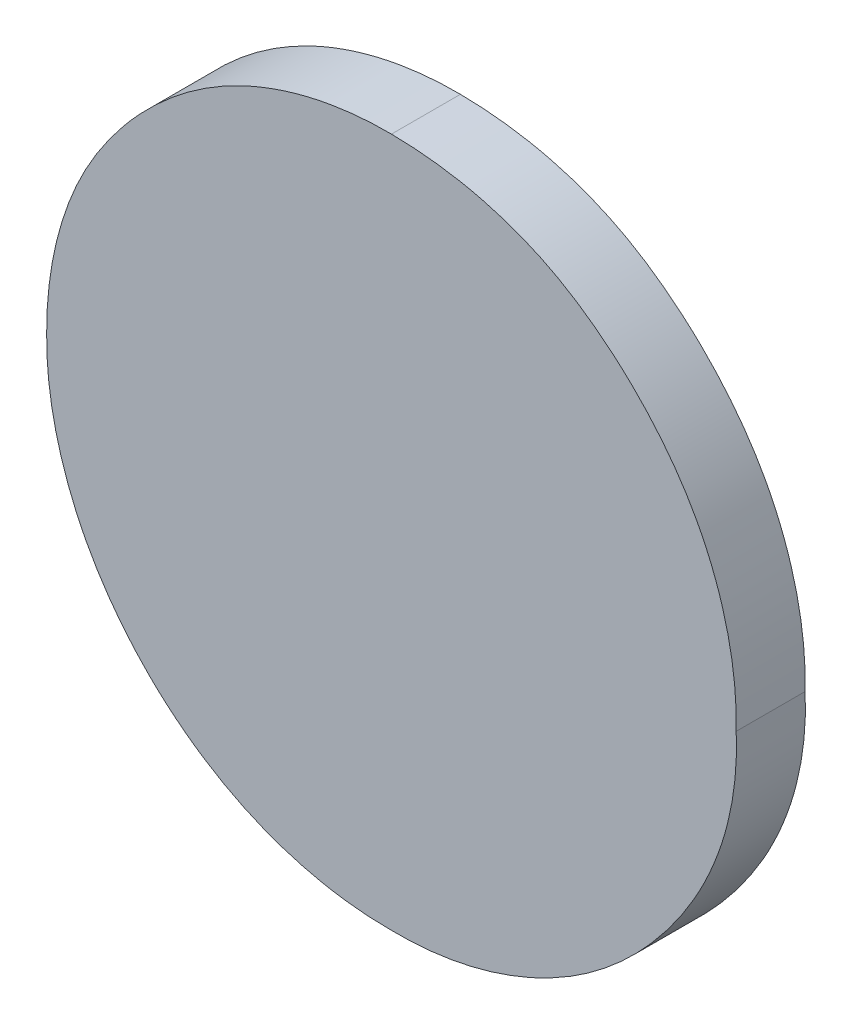
ISO-10303-21;
HEADER;
FILE_DESCRIPTION(('STEP AP214'),'2;1');
FILE_NAME('part.step','',(''),(''),'','','');
FILE_SCHEMA(('AUTOMOTIVE_DESIGN { 1 0 10303 214 1 1 1 1 }'));
ENDSEC;
DATA;
#1=APPLICATION_CONTEXT('core data for automotive mechanical design processes');
#2=APPLICATION_PROTOCOL_DEFINITION('international standard','automotive_design',2000,#1);
#3=PRODUCT_CONTEXT('',#1,'mechanical');
#4=PRODUCT('Part','Part','',(#3));
#5=PRODUCT_RELATED_PRODUCT_CATEGORY('part','',(#4));
#6=PRODUCT_DEFINITION_FORMATION('','',#4);
#7=PRODUCT_DEFINITION_CONTEXT('part definition',#1,'design');
#8=PRODUCT_DEFINITION('design','',#6,#7);
#9=PRODUCT_DEFINITION_SHAPE('','',#8);
#10=(LENGTH_UNIT() NAMED_UNIT(*) SI_UNIT(.MILLI.,.METRE.));
#11=(NAMED_UNIT(*) PLANE_ANGLE_UNIT() SI_UNIT($,.RADIAN.));
#12=(NAMED_UNIT(*) SI_UNIT($,.STERADIAN.) SOLID_ANGLE_UNIT());
#13=UNCERTAINTY_MEASURE_WITH_UNIT(LENGTH_MEASURE(1.E-05),#10,'distance_accuracy_value','');
#14=(GEOMETRIC_REPRESENTATION_CONTEXT(3) GLOBAL_UNCERTAINTY_ASSIGNED_CONTEXT((#13)) GLOBAL_UNIT_ASSIGNED_CONTEXT((#10,
#11,#12)) REPRESENTATION_CONTEXT('',''));
#15=CARTESIAN_POINT('',(0.,0.,0.));
#16=DIRECTION('',(0.,0.,1.));
#17=DIRECTION('',(1.,0.,0.));
#18=AXIS2_PLACEMENT_3D('',#15,#16,#17);
#19=CARTESIAN_POINT('',(0.44905628818307,1.01311472539116,0.551));
#20=CARTESIAN_POINT('',(0.44905628818307,1.01311472539116,0.55));
#21=CARTESIAN_POINT('',(0.449074495598878,1.01345328618512,0.551));
#22=CARTESIAN_POINT('',(0.449074495598878,1.01345328618512,0.55));
#23=CARTESIAN_POINT('',(0.449110043343719,1.0141142845851,0.551));
#24=CARTESIAN_POINT('',(0.449110043343719,1.0141142845851,0.55));
#25=CARTESIAN_POINT('',(0.449397626090893,1.015060554999,0.551));
#26=CARTESIAN_POINT('',(0.449397626090893,1.015060554999,0.55));
#27=CARTESIAN_POINT('',(0.449866932580689,1.01592058538614,0.551));
#28=CARTESIAN_POINT('',(0.449866932580689,1.01592058538614,0.55));
#29=CARTESIAN_POINT('',(0.450501310780555,1.01668166961683,0.551));
#30=CARTESIAN_POINT('',(0.450501310780555,1.01668166961683,0.55));
#31=CARTESIAN_POINT('',(0.451264584424357,1.01731916623396,0.551));
#32=CARTESIAN_POINT('',(0.451264584424357,1.01731916623396,0.55));
#33=CARTESIAN_POINT('',(0.452126805084551,1.01778313411635,0.551));
#34=CARTESIAN_POINT('',(0.452126805084551,1.01778313411635,0.55));
#35=CARTESIAN_POINT('',(0.453070340061191,1.01805811261096,0.551));
#36=CARTESIAN_POINT('',(0.453070340061191,1.01805811261096,0.55));
#37=CARTESIAN_POINT('',(0.453721939005433,1.01809552718379,0.551));
#38=CARTESIAN_POINT('',(0.453721939005433,1.01809552718379,0.55));
#39=CARTESIAN_POINT('',(0.45405628818307,1.01811472539116,0.551));
#40=CARTESIAN_POINT('',(0.45405628818307,1.01811472539116,0.55));
#41=B_SPLINE_SURFACE_WITH_KNOTS('',3,1,((#19,#20),(#21,#22),(#23,#24),(#25,#26),(#27,#28),(#29,
#30),(#31,#32),(#33,#34),(#35,#36),(#37,#38),(#39,#40)),.UNSPECIFIED.,.F.,.F.,.F.,(4,1,1,1,1,1,
1,1,4),(2,2),(0.,0.129096958167225,0.25204596725998,0.373904964402,0.501037835220211,
0.628170706038421,0.751376463409198,0.872426013370455,1.),(0.,1.),.UNSPECIFIED.);
#42=CARTESIAN_POINT('',(0.44905628818307,1.01311472539116,0.55));
#43=CARTESIAN_POINT('',(0.449054935449828,1.01345517990915,0.55));
#44=CARTESIAN_POINT('',(0.449087450089312,1.01379781815018,0.55));
#45=CARTESIAN_POINT('',(0.44923707957092,1.01455150678429,0.55));
#46=CARTESIAN_POINT('',(0.449372831094389,1.01495895061159,0.55));
#47=CARTESIAN_POINT('',(0.44975417080457,1.01572544032933,0.55));
#48=CARTESIAN_POINT('',(0.450001417509122,1.01608364470744,0.55));
#49=CARTESIAN_POINT('',(0.450628704194548,1.01679879499822,0.55));
#50=CARTESIAN_POINT('',(0.451025341191159,1.01714146095945,0.55));
#51=CARTESIAN_POINT('',(0.451870169674499,1.01765527462897,0.55));
#52=CARTESIAN_POINT('',(0.452310703467792,1.01783890743527,0.55));
#53=CARTESIAN_POINT('',(0.45318865721681,1.01806600906221,0.55));
#54=CARTESIAN_POINT('',(0.45362349226333,1.01811953971669,0.55));
#55=CARTESIAN_POINT('',(0.45405628818307,1.01811472539116,0.55));
#56=B_SPLINE_CURVE_WITH_KNOTS('',3,(#42,#43,#44,#45,#46,#47,#48,#49,#50,#51,#52,#53,#54,#55),
.UNSPECIFIED.,.F.,.F.,(4,2,2,2,2,2,4),(0.,0.00102380235933688,0.00229637067166441,
0.00358852723842867,0.00513641999990213,0.00654746971819192,0.00784533010584381),.UNSPECIFIED.);
#57=CARTESIAN_POINT('',(0.44905628818307,1.01311472539116,0.55));
#58=VERTEX_POINT('',#57);
#59=CARTESIAN_POINT('',(0.45405628818307,1.01811472539116,0.55));
#60=VERTEX_POINT('',#59);
#61=EDGE_CURVE('E11',#58,#60,#56,.T.);
#62=DIRECTION('',(0.,0.,-1.));
#63=VECTOR('',#62,1.);
#64=CARTESIAN_POINT('',(0.44905628818307,1.01311472539116,0.551));
#65=LINE('',#64,#63);
#66=CARTESIAN_POINT('',(0.44905628818307,1.01311472539116,0.551));
#67=VERTEX_POINT('',#66);
#68=EDGE_CURVE('E135',#67,#58,#65,.T.);
#69=CARTESIAN_POINT('',(0.44905628818307,1.01311472539116,0.551));
#70=CARTESIAN_POINT('',(0.449054935449828,1.01345517990915,0.551));
#71=CARTESIAN_POINT('',(0.449087450089312,1.01379781815018,0.551));
#72=CARTESIAN_POINT('',(0.44923707957092,1.01455150678428,0.551));
#73=CARTESIAN_POINT('',(0.44937283109439,1.01495895061159,0.551));
#74=CARTESIAN_POINT('',(0.44975417080457,1.01572544032933,0.551));
#75=CARTESIAN_POINT('',(0.450001417509122,1.01608364470744,0.551));
#76=CARTESIAN_POINT('',(0.450628704194548,1.01679879499822,0.551));
#77=CARTESIAN_POINT('',(0.45102534119116,1.01714146095945,0.551));
#78=CARTESIAN_POINT('',(0.4518701696745,1.01765527462897,0.551));
#79=CARTESIAN_POINT('',(0.452310703467792,1.01783890743527,0.551));
#80=CARTESIAN_POINT('',(0.453188657216809,1.01806600906221,0.551));
#81=CARTESIAN_POINT('',(0.453623492263329,1.01811953971669,0.551));
#82=CARTESIAN_POINT('',(0.45405628818307,1.01811472539116,0.551));
#83=B_SPLINE_CURVE_WITH_KNOTS('',3,(#69,#70,#71,#72,#73,#74,#75,#76,#77,#78,#79,#80,#81,#82),
.UNSPECIFIED.,.F.,.F.,(4,2,2,2,2,2,4),(0.,0.00102380235933688,0.00229637067166441,
0.00358852723842867,0.00513641999990287,0.00654746971819082,0.00784533010584373),.UNSPECIFIED.);
#84=CARTESIAN_POINT('',(0.45405628818307,1.01811472539116,0.551));
#85=VERTEX_POINT('',#84);
#86=EDGE_CURVE('E143',#67,#85,#83,.T.);
#87=DIRECTION('',(0.,0.,-1.));
#88=VECTOR('',#87,1.);
#89=CARTESIAN_POINT('',(0.45405628818307,1.01811472539116,0.551));
#90=LINE('',#89,#88);
#91=EDGE_CURVE('E80',#85,#60,#90,.T.);
#92=ORIENTED_EDGE('',*,*,#61,.F.);
#93=ORIENTED_EDGE('',*,*,#68,.F.);
#94=ORIENTED_EDGE('',*,*,#86,.T.);
#95=ORIENTED_EDGE('',*,*,#91,.T.);
#96=EDGE_LOOP('',(#92,#93,#94,#95));
#97=FACE_BOUND('',#96,.T.);
#98=ADVANCED_FACE('F17',(#97),#41,.T.);
#99=CARTESIAN_POINT('',(0.45405628818307,1.00811472539116,0.551));
#100=CARTESIAN_POINT('',(0.45405628818307,1.00811472539116,0.55));
#101=CARTESIAN_POINT('',(0.453721558371895,1.00813261562845,0.551));
#102=CARTESIAN_POINT('',(0.453721558371895,1.00813261562845,0.55));
#103=CARTESIAN_POINT('',(0.453068078098445,1.00816754205798,0.551));
#104=CARTESIAN_POINT('',(0.453068078098445,1.00816754205798,0.55));
#105=CARTESIAN_POINT('',(0.452128889625928,1.00846176159417,0.551));
#106=CARTESIAN_POINT('',(0.452128889625928,1.00846176159417,0.55));
#107=CARTESIAN_POINT('',(0.451264770164578,1.00892159234121,0.551));
#108=CARTESIAN_POINT('',(0.451264770164578,1.00892159234121,0.55));
#109=CARTESIAN_POINT('',(0.450496980820515,1.00956045364663,0.551));
#110=CARTESIAN_POINT('',(0.450496980820515,1.00956045364663,0.55));
#111=CARTESIAN_POINT('',(0.449870607021862,1.01033188467627,0.551));
#112=CARTESIAN_POINT('',(0.449870607021862,1.01033188467627,0.55));
#113=CARTESIAN_POINT('',(0.449397029030096,1.01119248690081,0.551));
#114=CARTESIAN_POINT('',(0.449397029030096,1.01119248690081,0.55));
#115=CARTESIAN_POINT('',(0.449112626476617,1.0121315972565,0.551));
#116=CARTESIAN_POINT('',(0.449112626476617,1.0121315972565,0.55));
#117=CARTESIAN_POINT('',(0.449075222945185,1.01278430541948,0.551));
#118=CARTESIAN_POINT('',(0.449075222945185,1.01278430541948,0.55));
#119=CARTESIAN_POINT('',(0.44905628818307,1.01311472539116,0.551));
#120=CARTESIAN_POINT('',(0.44905628818307,1.01311472539116,0.55));
#121=B_SPLINE_SURFACE_WITH_KNOTS('',3,1,((#99,#100),(#101,#102),(#103,#104),(#105,#106),(#107,
#108),(#109,#110),(#111,#112),(#113,#114),(#115,#116),(#117,#118),(#119,#120)),.UNSPECIFIED.,
.F.,.F.,.F.,(4,1,1,1,1,1,1,1,4),(2,2),(0.,0.127756603310131,0.24941435533653,0.372796476455405,
0.500111332515852,0.628609940765116,0.750643373825818,0.87376837914253,1.),(0.,1.),.UNSPECIFIED.);
#122=CARTESIAN_POINT('',(0.45405628818307,1.00811472539116,0.55));
#123=CARTESIAN_POINT('',(0.453718786892706,1.00811250210859,0.55));
#124=CARTESIAN_POINT('',(0.453380698374391,1.00814558278958,0.55));
#125=CARTESIAN_POINT('',(0.452640413714965,1.00829533080317,0.55));
#126=CARTESIAN_POINT('',(0.452241724402039,1.00842974288875,0.55));
#127=CARTESIAN_POINT('',(0.451423404943235,1.00883057793831,0.55));
#128=CARTESIAN_POINT('',(0.451013365480481,1.00911670458406,0.55));
#129=CARTESIAN_POINT('',(0.45028779676664,1.0097955714469,0.55));
#130=CARTESIAN_POINT('',(0.449973178061196,1.01018927459045,0.55));
#131=CARTESIAN_POINT('',(0.44947847401318,1.01104222215109,0.55));
#132=CARTESIAN_POINT('',(0.449295398722524,1.01149970740789,0.55));
#133=CARTESIAN_POINT('',(0.449095224348268,1.01234700875374,0.55));
#134=CARTESIAN_POINT('',(0.449051220069847,1.01273068588496,0.55));
#135=CARTESIAN_POINT('',(0.44905628818307,1.01311472539116,0.55));
#136=B_SPLINE_CURVE_WITH_KNOTS('',3,(#122,#123,#124,#125,#126,#127,#128,#129,#130,#131,#132,
#133,#134,#135),.UNSPECIFIED.,.F.,.F.,(4,2,2,2,2,2,4),(0.,0.00101171540562987,
0.00226012530857957,0.00373770364105078,0.00522896754965536,0.00668515982762755,
0.00783352206638879),.UNSPECIFIED.);
#137=CARTESIAN_POINT('',(0.45405628818307,1.00811472539116,0.55));
#138=VERTEX_POINT('',#137);
#139=EDGE_CURVE('E32',#138,#58,#136,.T.);
#140=DIRECTION('',(0.,0.,-1.));
#141=VECTOR('',#140,1.);
#142=CARTESIAN_POINT('',(0.45405628818307,1.00811472539116,0.551));
#143=LINE('',#142,#141);
#144=CARTESIAN_POINT('',(0.45405628818307,1.00811472539116,0.551));
#145=VERTEX_POINT('',#144);
#146=EDGE_CURVE('E142',#145,#138,#143,.T.);
#147=CARTESIAN_POINT('',(0.45405628818307,1.00811472539116,0.551));
#148=CARTESIAN_POINT('',(0.453718786892706,1.00811250210859,0.551));
#149=CARTESIAN_POINT('',(0.453380698374391,1.00814558278958,0.551));
#150=CARTESIAN_POINT('',(0.452640413714965,1.00829533080317,0.551));
#151=CARTESIAN_POINT('',(0.452241724402039,1.00842974288875,0.551));
#152=CARTESIAN_POINT('',(0.451423404943235,1.00883057793831,0.551));
#153=CARTESIAN_POINT('',(0.451013365480481,1.00911670458406,0.551));
#154=CARTESIAN_POINT('',(0.45028779676664,1.0097955714469,0.551));
#155=CARTESIAN_POINT('',(0.449973178061196,1.01018927459045,0.551));
#156=CARTESIAN_POINT('',(0.44947847401318,1.01104222215109,0.551));
#157=CARTESIAN_POINT('',(0.449295398722524,1.01149970740789,0.551));
#158=CARTESIAN_POINT('',(0.449095224348268,1.01234700875374,0.551));
#159=CARTESIAN_POINT('',(0.449051220069847,1.01273068588496,0.551));
#160=CARTESIAN_POINT('',(0.44905628818307,1.01311472539116,0.551));
#161=B_SPLINE_CURVE_WITH_KNOTS('',3,(#147,#148,#149,#150,#151,#152,#153,#154,#155,#156,#157,
#158,#159,#160),.UNSPECIFIED.,.F.,.F.,(4,2,2,2,2,2,4),(0.,0.00101171540562987,
0.00226012530857957,0.00373770364105078,0.00522896754965536,0.00668515982762755,
0.00783352206638879),.UNSPECIFIED.);
#162=EDGE_CURVE('E74',#145,#67,#161,.T.);
#163=ORIENTED_EDGE('',*,*,#139,.F.);
#164=ORIENTED_EDGE('',*,*,#146,.F.);
#165=ORIENTED_EDGE('',*,*,#162,.T.);
#166=ORIENTED_EDGE('',*,*,#68,.T.);
#167=EDGE_LOOP('',(#163,#164,#165,#166));
#168=FACE_BOUND('',#167,.T.);
#169=ADVANCED_FACE('F118',(#168),#121,.T.);
#170=CARTESIAN_POINT('',(0.45905628818307,1.01311472539116,0.551));
#171=CARTESIAN_POINT('',(0.45905628818307,1.01311472539116,0.55));
#172=CARTESIAN_POINT('',(0.45903579217029,1.01278483973809,0.551));
#173=CARTESIAN_POINT('',(0.45903579217029,1.01278483973809,0.55));
#174=CARTESIAN_POINT('',(0.458995374334092,1.0121343100749,0.551));
#175=CARTESIAN_POINT('',(0.458995374334092,1.0121343100749,0.55));
#176=CARTESIAN_POINT('',(0.458733729623309,1.01118662785849,0.551));
#177=CARTESIAN_POINT('',(0.458733729623309,1.01118662785849,0.55));
#178=CARTESIAN_POINT('',(0.458238334476508,1.01033588092472,0.551));
#179=CARTESIAN_POINT('',(0.458238334476508,1.01033588092472,0.55));
#180=CARTESIAN_POINT('',(0.457617163169269,1.00955927284252,0.551));
#181=CARTESIAN_POINT('',(0.457617163169269,1.00955927284252,0.55));
#182=CARTESIAN_POINT('',(0.45684922430827,1.00892600077495,0.551));
#183=CARTESIAN_POINT('',(0.45684922430827,1.00892600077495,0.55));
#184=CARTESIAN_POINT('',(0.455990335512453,1.00845588629383,0.551));
#185=CARTESIAN_POINT('',(0.455990335512453,1.00845588629383,0.55));
#186=CARTESIAN_POINT('',(0.45504762822976,1.00816973806681,0.551));
#187=CARTESIAN_POINT('',(0.45504762822976,1.00816973806681,0.55));
#188=CARTESIAN_POINT('',(0.454390776972362,1.00813328725934,0.551));
#189=CARTESIAN_POINT('',(0.454390776972362,1.00813328725934,0.55));
#190=CARTESIAN_POINT('',(0.45405628818307,1.00811472539116,0.551));
#191=CARTESIAN_POINT('',(0.45405628818307,1.00811472539116,0.55));
#192=B_SPLINE_SURFACE_WITH_KNOTS('',3,1,((#170,#171),(#172,#173),(#174,#175),(#176,#177),(#178,
#179),(#180,#181),(#182,#183),(#184,#185),(#186,#187),(#188,#189),(#190,#191)),.UNSPECIFIED.,
.F.,.F.,.F.,(4,1,1,1,1,1,1,1,4),(2,2),(0.,0.12617771831699,0.248820607485782,0.371539969235141,
0.499983706910885,0.627244197875359,0.749225521076267,0.872297950417651,1.),(0.,1.),.UNSPECIFIED.);
#193=CARTESIAN_POINT('',(0.45905628818307,1.01311472539116,0.55));
#194=CARTESIAN_POINT('',(0.459091698220716,1.01231128479108,0.55));
#195=CARTESIAN_POINT('',(0.458893242729008,1.0115495939592,0.55));
#196=CARTESIAN_POINT('',(0.45835147045371,1.01051718944485,0.55));
#197=CARTESIAN_POINT('',(0.45812442781851,1.01018703419215,0.55));
#198=CARTESIAN_POINT('',(0.457557804992493,1.009524243865,0.55));
#199=CARTESIAN_POINT('',(0.457205114765354,1.00920271206402,0.55));
#200=CARTESIAN_POINT('',(0.456398014024578,1.00865962360957,0.55));
#201=CARTESIAN_POINT('',(0.455938948898806,1.00844481563176,0.55));
#202=CARTESIAN_POINT('',(0.455003796265871,1.00817168531907,0.55));
#203=CARTESIAN_POINT('',(0.454529957278226,1.00810555781945,0.55));
#204=CARTESIAN_POINT('',(0.45405628818307,1.00811472539116,0.55));
#205=B_SPLINE_CURVE_WITH_KNOTS('',3,(#193,#194,#195,#196,#197,#198,#199,#200,#201,#202,#203,
#204),.UNSPECIFIED.,.F.,.F.,(4,2,2,2,2,4),(0.,0.00230515943149246,0.00349686753796663,
0.00491163967331225,0.00640711009768603,0.00782203466010681),.UNSPECIFIED.);
#206=CARTESIAN_POINT('',(0.45905628818307,1.01311472539116,0.55));
#207=VERTEX_POINT('',#206);
#208=EDGE_CURVE('E70',#207,#138,#205,.T.);
#209=DIRECTION('',(0.,0.,-1.));
#210=VECTOR('',#209,1.);
#211=CARTESIAN_POINT('',(0.45905628818307,1.01311472539116,0.551));
#212=LINE('',#211,#210);
#213=CARTESIAN_POINT('',(0.45905628818307,1.01311472539116,0.551));
#214=VERTEX_POINT('',#213);
#215=EDGE_CURVE('E63',#214,#207,#212,.T.);
#216=CARTESIAN_POINT('',(0.45905628818307,1.01311472539116,0.551));
#217=CARTESIAN_POINT('',(0.459091698220716,1.01231128479108,0.551));
#218=CARTESIAN_POINT('',(0.458893242729008,1.0115495939592,0.551));
#219=CARTESIAN_POINT('',(0.45835147045371,1.01051718944485,0.551));
#220=CARTESIAN_POINT('',(0.45812442781851,1.01018703419215,0.551));
#221=CARTESIAN_POINT('',(0.457557804992493,1.009524243865,0.551));
#222=CARTESIAN_POINT('',(0.457205114765354,1.00920271206402,0.551));
#223=CARTESIAN_POINT('',(0.456398014024578,1.00865962360957,0.551));
#224=CARTESIAN_POINT('',(0.455938948898806,1.00844481563176,0.551));
#225=CARTESIAN_POINT('',(0.455003796265871,1.00817168531907,0.551));
#226=CARTESIAN_POINT('',(0.454529957278226,1.00810555781945,0.551));
#227=CARTESIAN_POINT('',(0.45405628818307,1.00811472539116,0.551));
#228=B_SPLINE_CURVE_WITH_KNOTS('',3,(#216,#217,#218,#219,#220,#221,#222,#223,#224,#225,#226,
#227),.UNSPECIFIED.,.F.,.F.,(4,2,2,2,2,4),(0.,0.00230515943149246,0.00349686753796663,
0.00491163967331225,0.00640711009768603,0.00782203466010681),.UNSPECIFIED.);
#229=EDGE_CURVE('E67',#214,#145,#228,.T.);
#230=ORIENTED_EDGE('',*,*,#208,.F.);
#231=ORIENTED_EDGE('',*,*,#215,.F.);
#232=ORIENTED_EDGE('',*,*,#229,.T.);
#233=ORIENTED_EDGE('',*,*,#146,.T.);
#234=EDGE_LOOP('',(#230,#231,#232,#233));
#235=FACE_BOUND('',#234,.T.);
#236=ADVANCED_FACE('F65',(#235),#192,.T.);
#237=CARTESIAN_POINT('',(0.45405628818307,1.01811472539116,0.551));
#238=CARTESIAN_POINT('',(0.45405628818307,1.01811472539116,0.55));
#239=CARTESIAN_POINT('',(0.454390406106035,1.0180948711051,0.551));
#240=CARTESIAN_POINT('',(0.454390406106035,1.0180948711051,0.55));
#241=CARTESIAN_POINT('',(0.455045405232783,1.01805594909843,0.551));
#242=CARTESIAN_POINT('',(0.455045405232783,1.01805594909843,0.55));
#243=CARTESIAN_POINT('',(0.455992361718199,1.0177889204054,0.551));
#244=CARTESIAN_POINT('',(0.455992361718199,1.0177889204054,0.55));
#245=CARTESIAN_POINT('',(0.456849413027574,1.01731477194018,0.551));
#246=CARTESIAN_POINT('',(0.456849413027574,1.01731477194018,0.55));
#247=CARTESIAN_POINT('',(0.457612822938203,1.01668283859683,0.551));
#248=CARTESIAN_POINT('',(0.457612822938203,1.01668283859683,0.55));
#249=CARTESIAN_POINT('',(0.458242076821476,1.01591662722888,0.551));
#250=CARTESIAN_POINT('',(0.458242076821476,1.01591662722888,0.55));
#251=CARTESIAN_POINT('',(0.458733122857953,1.01506641165055,0.551));
#252=CARTESIAN_POINT('',(0.458733122857953,1.01506641165055,0.55));
#253=CARTESIAN_POINT('',(0.458997825461586,1.01411152720633,0.551));
#254=CARTESIAN_POINT('',(0.458997825461586,1.01411152720633,0.55));
#255=CARTESIAN_POINT('',(0.459036463949768,1.0134527327784,0.551));
#256=CARTESIAN_POINT('',(0.459036463949768,1.0134527327784,0.55));
#257=CARTESIAN_POINT('',(0.45905628818307,1.01311472539116,0.551));
#258=CARTESIAN_POINT('',(0.45905628818307,1.01311472539116,0.55));
#259=B_SPLINE_SURFACE_WITH_KNOTS('',3,1,((#237,#238),(#239,#240),(#241,#242),(#243,#244),(#245,
#246),(#247,#248),(#249,#250),(#251,#252),(#253,#254),(#255,#256),(#257,#258)),.UNSPECIFIED.,
.F.,.F.,.F.,(4,1,1,1,1,1,1,1,4),(2,2),(0.,0.127518926699943,0.249985947748801,0.371792351505745,
0.498870352776469,0.625948354047194,0.748491738016055,0.870958759064918,1.),(0.,1.),.UNSPECIFIED.);
#260=CARTESIAN_POINT('',(0.45405628818307,1.01811472539116,0.55));
#261=CARTESIAN_POINT('',(0.454391462387858,1.01811209716723,0.55));
#262=CARTESIAN_POINT('',(0.454730354637737,1.01808049207193,0.55));
#263=CARTESIAN_POINT('',(0.45550245200476,1.01793313615294,0.55));
#264=CARTESIAN_POINT('',(0.45593131932933,1.01779379182381,0.55));
#265=CARTESIAN_POINT('',(0.456710947676083,1.01739734551313,0.55));
#266=CARTESIAN_POINT('',(0.457063895718266,1.01714447941195,0.55));
#267=CARTESIAN_POINT('',(0.457776564947659,1.01650251779543,0.55));
#268=CARTESIAN_POINT('',(0.458120371090322,1.01609563777763,0.55));
#269=CARTESIAN_POINT('',(0.458613138812652,1.01526476239132,0.55));
#270=CARTESIAN_POINT('',(0.458784745626889,1.0148544037533,0.55));
#271=CARTESIAN_POINT('',(0.459011585550635,1.01400071453088,0.55));
#272=CARTESIAN_POINT('',(0.459066266387475,1.0135572376668,0.55));
#273=CARTESIAN_POINT('',(0.45905628818307,1.01311472539116,0.55));
#274=B_SPLINE_CURVE_WITH_KNOTS('',3,(#260,#261,#262,#263,#264,#265,#266,#267,#268,#269,#270,
#271,#272,#273),.UNSPECIFIED.,.F.,.F.,(4,2,2,2,2,2,4),(0.,0.00101182088140865,
0.00234589379881517,0.00363386383793548,0.00520796923802035,0.00652511171315989,
0.00784846178707011),.UNSPECIFIED.);
#275=EDGE_CURVE('E73',#60,#207,#274,.T.);
#276=CARTESIAN_POINT('',(0.45405628818307,1.01811472539116,0.551));
#277=CARTESIAN_POINT('',(0.454391462387858,1.01811209716723,0.551));
#278=CARTESIAN_POINT('',(0.454730354637737,1.01808049207193,0.551));
#279=CARTESIAN_POINT('',(0.45550245200476,1.01793313615294,0.551));
#280=CARTESIAN_POINT('',(0.45593131932933,1.01779379182381,0.551));
#281=CARTESIAN_POINT('',(0.456710947676083,1.01739734551313,0.551));
#282=CARTESIAN_POINT('',(0.457063895718266,1.01714447941195,0.551));
#283=CARTESIAN_POINT('',(0.457776564947659,1.01650251779543,0.551));
#284=CARTESIAN_POINT('',(0.458120371090322,1.01609563777763,0.551));
#285=CARTESIAN_POINT('',(0.458613138812652,1.01526476239132,0.551));
#286=CARTESIAN_POINT('',(0.458784745626889,1.0148544037533,0.551));
#287=CARTESIAN_POINT('',(0.459011585550635,1.01400071453088,0.551));
#288=CARTESIAN_POINT('',(0.459066266387475,1.0135572376668,0.551));
#289=CARTESIAN_POINT('',(0.45905628818307,1.01311472539116,0.551));
#290=B_SPLINE_CURVE_WITH_KNOTS('',3,(#276,#277,#278,#279,#280,#281,#282,#283,#284,#285,#286,
#287,#288,#289),.UNSPECIFIED.,.F.,.F.,(4,2,2,2,2,2,4),(0.,0.00101182088140865,
0.00234589379881517,0.00363386383793548,0.00520796923802035,0.00652511171315989,
0.00784846178707011),.UNSPECIFIED.);
#291=EDGE_CURVE('E78',#85,#214,#290,.T.);
#292=ORIENTED_EDGE('',*,*,#275,.F.);
#293=ORIENTED_EDGE('',*,*,#91,.F.);
#294=ORIENTED_EDGE('',*,*,#291,.T.);
#295=ORIENTED_EDGE('',*,*,#215,.T.);
#296=EDGE_LOOP('',(#292,#293,#294,#295));
#297=FACE_BOUND('',#296,.T.);
#298=ADVANCED_FACE('F79',(#297),#259,.T.);
#299=CARTESIAN_POINT('',(0.450516865095759,1.01665461500681,0.551));
#300=DIRECTION('',(0.,0.,1.));
#301=DIRECTION('',(1.,0.,0.));
#302=AXIS2_PLACEMENT_3D('',#299,#300,#301);
#303=PLANE('',#302);
#304=ORIENTED_EDGE('',*,*,#86,.F.);
#305=ORIENTED_EDGE('',*,*,#162,.F.);
#306=ORIENTED_EDGE('',*,*,#229,.F.);
#307=ORIENTED_EDGE('',*,*,#291,.F.);
#308=EDGE_LOOP('',(#304,#305,#306,#307));
#309=FACE_BOUND('',#308,.T.);
#310=ADVANCED_FACE('F84',(#309),#303,.T.);
#311=CARTESIAN_POINT('',(0.450516865095759,1.01665461500681,0.55));
#312=DIRECTION('',(0.,0.,1.));
#313=DIRECTION('',(1.,0.,0.));
#314=AXIS2_PLACEMENT_3D('',#311,#312,#313);
#315=PLANE('',#314);
#316=ORIENTED_EDGE('',*,*,#61,.T.);
#317=ORIENTED_EDGE('',*,*,#275,.T.);
#318=ORIENTED_EDGE('',*,*,#208,.T.);
#319=ORIENTED_EDGE('',*,*,#139,.T.);
#320=EDGE_LOOP('',(#316,#317,#318,#319));
#321=FACE_BOUND('',#320,.T.);
#322=ADVANCED_FACE('F105',(#321),#315,.F.);
#323=CLOSED_SHELL('',(#98,#169,#236,#298,#310,#322));
#324=MANIFOLD_SOLID_BREP('B1',#323);
#325=ADVANCED_BREP_SHAPE_REPRESENTATION('',(#18,#324),#14);
#326=SHAPE_DEFINITION_REPRESENTATION(#9,#325);
ENDSEC;
END-ISO-10303-21;
